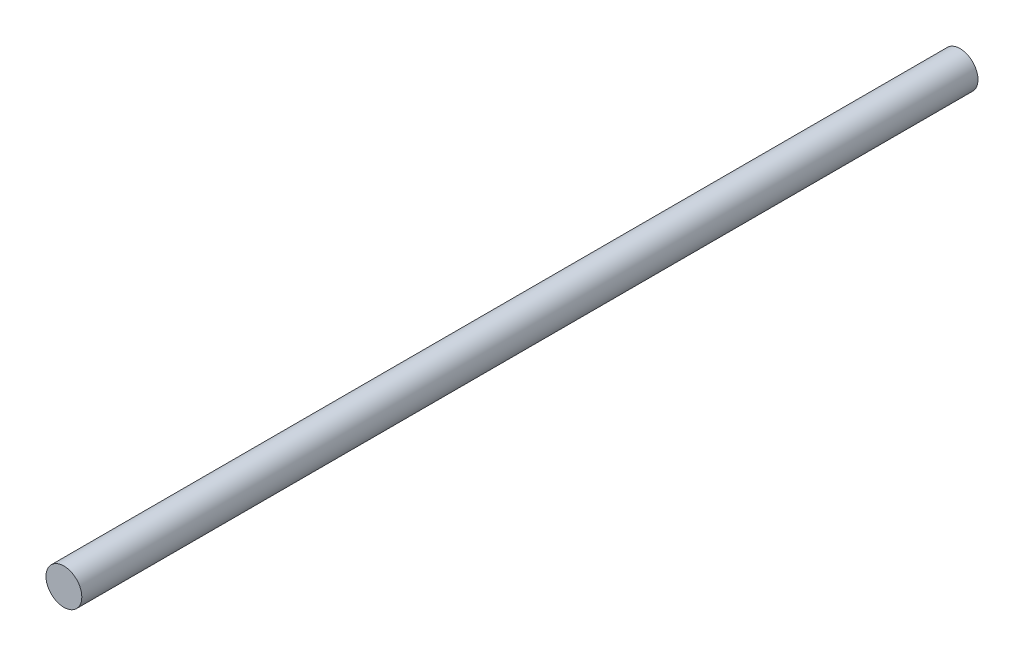
ISO-10303-21;
HEADER;
FILE_DESCRIPTION(('STEP AP214'),'2;1');
FILE_NAME('part.step','',(''),(''),'','','');
FILE_SCHEMA(('AUTOMOTIVE_DESIGN { 1 0 10303 214 1 1 1 1 }'));
ENDSEC;
DATA;
#1=APPLICATION_CONTEXT('core data for automotive mechanical design processes');
#2=APPLICATION_PROTOCOL_DEFINITION('international standard','automotive_design',2000,#1);
#3=PRODUCT_CONTEXT('',#1,'mechanical');
#4=PRODUCT('Part','Part','',(#3));
#5=PRODUCT_RELATED_PRODUCT_CATEGORY('part','',(#4));
#6=PRODUCT_DEFINITION_FORMATION('','',#4);
#7=PRODUCT_DEFINITION_CONTEXT('part definition',#1,'design');
#8=PRODUCT_DEFINITION('design','',#6,#7);
#9=PRODUCT_DEFINITION_SHAPE('','',#8);
#10=(LENGTH_UNIT() NAMED_UNIT(*) SI_UNIT(.MILLI.,.METRE.));
#11=(NAMED_UNIT(*) PLANE_ANGLE_UNIT() SI_UNIT($,.RADIAN.));
#12=(NAMED_UNIT(*) SI_UNIT($,.STERADIAN.) SOLID_ANGLE_UNIT());
#13=UNCERTAINTY_MEASURE_WITH_UNIT(LENGTH_MEASURE(1.E-05),#10,'distance_accuracy_value','');
#14=(GEOMETRIC_REPRESENTATION_CONTEXT(3) GLOBAL_UNCERTAINTY_ASSIGNED_CONTEXT((#13)) GLOBAL_UNIT_ASSIGNED_CONTEXT((#10,
#11,#12)) REPRESENTATION_CONTEXT('',''));
#15=CARTESIAN_POINT('',(0.,0.,0.));
#16=DIRECTION('',(0.,0.,1.));
#17=DIRECTION('',(1.,0.,0.));
#18=AXIS2_PLACEMENT_3D('',#15,#16,#17);
#19=CARTESIAN_POINT('',(0.,7.00000000000402,-16.2));
#20=DIRECTION('',(0.,0.,1.));
#21=DIRECTION('',(1.,0.,0.));
#22=AXIS2_PLACEMENT_3D('',#19,#20,#21);
#23=PLANE('',#22);
#24=CARTESIAN_POINT('',(0.,7.00000000000402,-16.2));
#25=DIRECTION('',(0.,0.,1.));
#26=DIRECTION('',(-1.,0.,0.));
#27=AXIS2_PLACEMENT_3D('',#24,#25,#26);
#28=CIRCLE('',#27,0.6);
#29=CARTESIAN_POINT('',(0.6,7.00000000000402,-16.2));
#30=VERTEX_POINT('',#29);
#31=EDGE_CURVE('E11',#30,#30,#28,.T.);
#32=ORIENTED_EDGE('',*,*,#31,.F.);
#33=EDGE_LOOP('',(#32));
#34=FACE_BOUND('',#33,.T.);
#35=ADVANCED_FACE('F16',(#34),#23,.F.);
#36=CARTESIAN_POINT('',(0.,7.00000000000402,13.8));
#37=DIRECTION('',(0.,0.,1.));
#38=DIRECTION('',(1.,0.,0.));
#39=AXIS2_PLACEMENT_3D('',#36,#37,#38);
#40=PLANE('',#39);
#41=CARTESIAN_POINT('',(0.,7.00000000000402,13.8));
#42=DIRECTION('',(0.,0.,1.));
#43=DIRECTION('',(-1.,0.,0.));
#44=AXIS2_PLACEMENT_3D('',#41,#42,#43);
#45=CIRCLE('',#44,0.6);
#46=CARTESIAN_POINT('',(0.6,7.00000000000402,13.8));
#47=VERTEX_POINT('',#46);
#48=EDGE_CURVE('E41',#47,#47,#45,.T.);
#49=ORIENTED_EDGE('',*,*,#48,.T.);
#50=EDGE_LOOP('',(#49));
#51=FACE_BOUND('',#50,.T.);
#52=ADVANCED_FACE('F18',(#51),#40,.T.);
#53=CARTESIAN_POINT('',(0.,7.00000000000402,-16.2));
#54=DIRECTION('',(0.,0.,1.));
#55=DIRECTION('',(-1.,0.,0.));
#56=AXIS2_PLACEMENT_3D('',#53,#54,#55);
#57=CYLINDRICAL_SURFACE('',#56,0.6);
#58=ORIENTED_EDGE('',*,*,#48,.F.);
#59=DIRECTION('',(0.,0.,-1.));
#60=VECTOR('',#59,1.);
#61=CARTESIAN_POINT('',(0.6,7.00000000000402,-16.2));
#62=LINE('',#61,#60);
#63=EDGE_CURVE('E25',#47,#30,#62,.T.);
#64=ORIENTED_EDGE('',*,*,#63,.T.);
#65=ORIENTED_EDGE('',*,*,#31,.T.);
#66=ORIENTED_EDGE('',*,*,#63,.F.);
#67=EDGE_LOOP('',(#58,#64,#65,#66));
#68=FACE_BOUND('',#67,.T.);
#69=ADVANCED_FACE('F40',(#68),#57,.T.);
#70=CLOSED_SHELL('',(#35,#52,#69));
#71=MANIFOLD_SOLID_BREP('B1',#70);
#72=ADVANCED_BREP_SHAPE_REPRESENTATION('',(#18,#71),#14);
#73=SHAPE_DEFINITION_REPRESENTATION(#9,#72);
ENDSEC;
END-ISO-10303-21;
